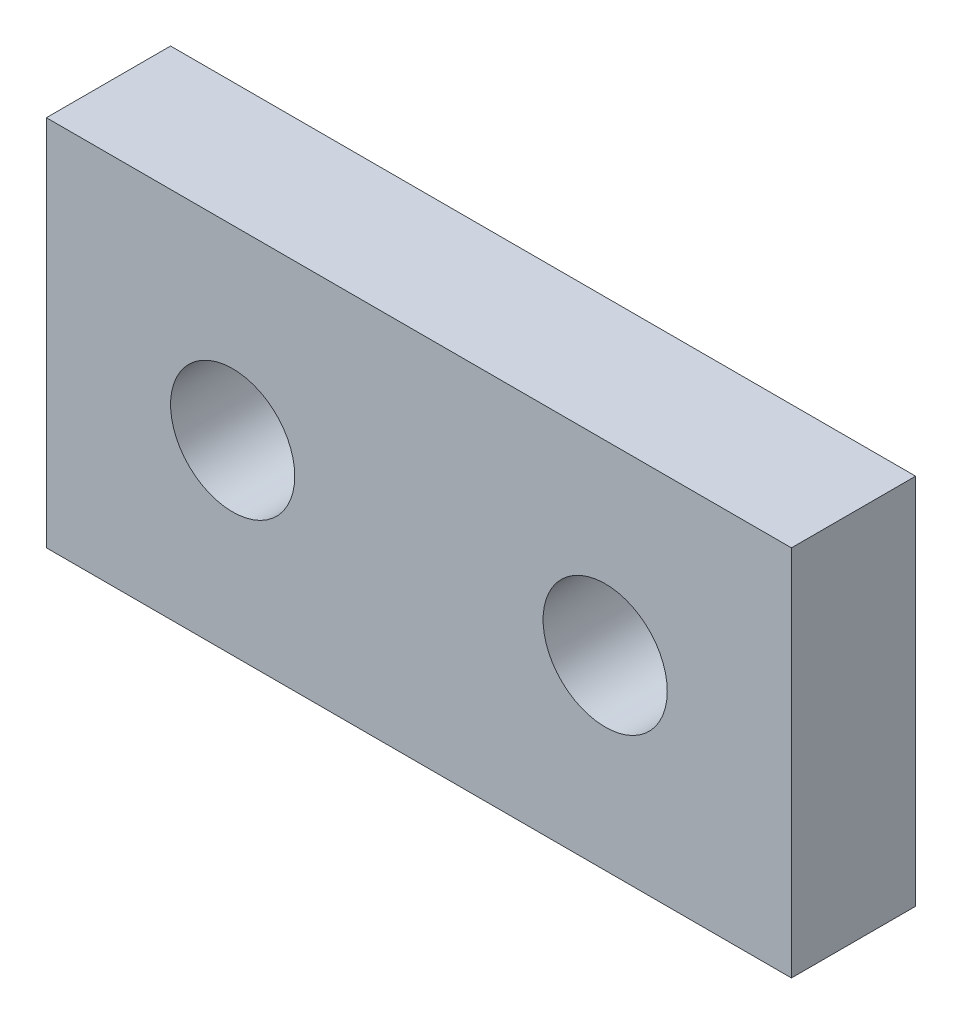
ISO-10303-21;
HEADER;
FILE_DESCRIPTION(('STEP AP214'),'2;1');
FILE_NAME('part.step','',(''),(''),'','','');
FILE_SCHEMA(('AUTOMOTIVE_DESIGN { 1 0 10303 214 1 1 1 1 }'));
ENDSEC;
DATA;
#1=APPLICATION_CONTEXT('core data for automotive mechanical design processes');
#2=APPLICATION_PROTOCOL_DEFINITION('international standard','automotive_design',2000,#1);
#3=PRODUCT_CONTEXT('',#1,'mechanical');
#4=PRODUCT('Part','Part','',(#3));
#5=PRODUCT_RELATED_PRODUCT_CATEGORY('part','',(#4));
#6=PRODUCT_DEFINITION_FORMATION('','',#4);
#7=PRODUCT_DEFINITION_CONTEXT('part definition',#1,'design');
#8=PRODUCT_DEFINITION('design','',#6,#7);
#9=PRODUCT_DEFINITION_SHAPE('','',#8);
#10=(LENGTH_UNIT() NAMED_UNIT(*) SI_UNIT(.MILLI.,.METRE.));
#11=(NAMED_UNIT(*) PLANE_ANGLE_UNIT() SI_UNIT($,.RADIAN.));
#12=(NAMED_UNIT(*) SI_UNIT($,.STERADIAN.) SOLID_ANGLE_UNIT());
#13=UNCERTAINTY_MEASURE_WITH_UNIT(LENGTH_MEASURE(1.E-05),#10,'distance_accuracy_value','');
#14=(GEOMETRIC_REPRESENTATION_CONTEXT(3) GLOBAL_UNCERTAINTY_ASSIGNED_CONTEXT((#13)) GLOBAL_UNIT_ASSIGNED_CONTEXT((#10,
#11,#12)) REPRESENTATION_CONTEXT('',''));
#15=CARTESIAN_POINT('',(0.,0.,0.));
#16=DIRECTION('',(0.,0.,1.));
#17=DIRECTION('',(1.,0.,0.));
#18=AXIS2_PLACEMENT_3D('',#15,#16,#17);
#19=CARTESIAN_POINT('',(0.,0.,10.));
#20=DIRECTION('',(0.,0.,1.));
#21=DIRECTION('',(1.,0.,0.));
#22=AXIS2_PLACEMENT_3D('',#19,#20,#21);
#23=PLANE('',#22);
#24=CARTESIAN_POINT('',(15.,15.,10.));
#25=DIRECTION('',(0.,0.,1.));
#26=DIRECTION('',(1.,0.,0.));
#27=AXIS2_PLACEMENT_3D('',#24,#25,#26);
#28=CIRCLE('',#27,5.);
#29=CARTESIAN_POINT('',(20.,15.,10.));
#30=VERTEX_POINT('',#29);
#31=EDGE_CURVE('E112',#30,#30,#28,.T.);
#32=ORIENTED_EDGE('',*,*,#31,.F.);
#33=EDGE_LOOP('',(#32));
#34=FACE_BOUND('',#33,.T.);
#35=DIRECTION('',(0.,-1.,0.));
#36=VECTOR('',#35,1.);
#37=CARTESIAN_POINT('',(0.,30.,10.));
#38=LINE('',#37,#36);
#39=CARTESIAN_POINT('',(0.,30.,10.));
#40=VERTEX_POINT('',#39);
#41=CARTESIAN_POINT('',(0.,0.,10.));
#42=VERTEX_POINT('',#41);
#43=EDGE_CURVE('E92',#40,#42,#38,.T.);
#44=ORIENTED_EDGE('',*,*,#43,.T.);
#45=DIRECTION('',(1.,0.,0.));
#46=VECTOR('',#45,1.);
#47=CARTESIAN_POINT('',(0.,0.,10.));
#48=LINE('',#47,#46);
#49=CARTESIAN_POINT('',(60.,0.,10.));
#50=VERTEX_POINT('',#49);
#51=EDGE_CURVE('E87',#42,#50,#48,.T.);
#52=ORIENTED_EDGE('',*,*,#51,.T.);
#53=DIRECTION('',(0.,1.,0.));
#54=VECTOR('',#53,1.);
#55=CARTESIAN_POINT('',(60.,0.,10.));
#56=LINE('',#55,#54);
#57=CARTESIAN_POINT('',(60.,30.,10.));
#58=VERTEX_POINT('',#57);
#59=EDGE_CURVE('E90',#50,#58,#56,.T.);
#60=ORIENTED_EDGE('',*,*,#59,.T.);
#61=DIRECTION('',(-1.,0.,0.));
#62=VECTOR('',#61,1.);
#63=CARTESIAN_POINT('',(60.,30.,10.));
#64=LINE('',#63,#62);
#65=EDGE_CURVE('E57',#58,#40,#64,.T.);
#66=ORIENTED_EDGE('',*,*,#65,.T.);
#67=EDGE_LOOP('',(#44,#52,#60,#66));
#68=FACE_BOUND('',#67,.T.);
#69=CARTESIAN_POINT('',(45.,15.,10.));
#70=DIRECTION('',(0.,0.,1.));
#71=DIRECTION('',(1.,0.,0.));
#72=AXIS2_PLACEMENT_3D('',#69,#70,#71);
#73=CIRCLE('',#72,5.);
#74=CARTESIAN_POINT('',(50.,15.,10.));
#75=VERTEX_POINT('',#74);
#76=EDGE_CURVE('E134',#75,#75,#73,.T.);
#77=ORIENTED_EDGE('',*,*,#76,.F.);
#78=EDGE_LOOP('',(#77));
#79=FACE_BOUND('',#78,.T.);
#80=ADVANCED_FACE('F39',(#34,#68,#79),#23,.T.);
#81=CARTESIAN_POINT('',(0.,0.,0.));
#82=DIRECTION('',(0.,0.,1.));
#83=DIRECTION('',(1.,0.,0.));
#84=AXIS2_PLACEMENT_3D('',#81,#82,#83);
#85=PLANE('',#84);
#86=DIRECTION('',(0.,-1.,0.));
#87=VECTOR('',#86,1.);
#88=CARTESIAN_POINT('',(0.,30.,0.));
#89=LINE('',#88,#87);
#90=CARTESIAN_POINT('',(0.,30.,0.));
#91=VERTEX_POINT('',#90);
#92=CARTESIAN_POINT('',(0.,0.,0.));
#93=VERTEX_POINT('',#92);
#94=EDGE_CURVE('E108',#91,#93,#89,.T.);
#95=ORIENTED_EDGE('',*,*,#94,.F.);
#96=DIRECTION('',(-1.,0.,0.));
#97=VECTOR('',#96,1.);
#98=CARTESIAN_POINT('',(60.,30.,0.));
#99=LINE('',#98,#97);
#100=CARTESIAN_POINT('',(60.,30.,0.));
#101=VERTEX_POINT('',#100);
#102=EDGE_CURVE('E80',#101,#91,#99,.T.);
#103=ORIENTED_EDGE('',*,*,#102,.F.);
#104=DIRECTION('',(0.,1.,0.));
#105=VECTOR('',#104,1.);
#106=CARTESIAN_POINT('',(60.,0.,0.));
#107=LINE('',#106,#105);
#108=CARTESIAN_POINT('',(60.,0.,0.));
#109=VERTEX_POINT('',#108);
#110=EDGE_CURVE('E74',#109,#101,#107,.T.);
#111=ORIENTED_EDGE('',*,*,#110,.F.);
#112=DIRECTION('',(1.,0.,0.));
#113=VECTOR('',#112,1.);
#114=CARTESIAN_POINT('',(0.,0.,0.));
#115=LINE('',#114,#113);
#116=EDGE_CURVE('E97',#93,#109,#115,.T.);
#117=ORIENTED_EDGE('',*,*,#116,.F.);
#118=EDGE_LOOP('',(#95,#103,#111,#117));
#119=FACE_BOUND('',#118,.T.);
#120=CARTESIAN_POINT('',(15.,15.,0.));
#121=DIRECTION('',(0.,0.,1.));
#122=DIRECTION('',(1.,0.,0.));
#123=AXIS2_PLACEMENT_3D('',#120,#121,#122);
#124=CIRCLE('',#123,5.);
#125=CARTESIAN_POINT('',(20.,15.,0.));
#126=VERTEX_POINT('',#125);
#127=EDGE_CURVE('E130',#126,#126,#124,.T.);
#128=ORIENTED_EDGE('',*,*,#127,.T.);
#129=EDGE_LOOP('',(#128));
#130=FACE_BOUND('',#129,.T.);
#131=CARTESIAN_POINT('',(45.,15.,0.));
#132=DIRECTION('',(0.,0.,1.));
#133=DIRECTION('',(1.,0.,0.));
#134=AXIS2_PLACEMENT_3D('',#131,#132,#133);
#135=CIRCLE('',#134,5.);
#136=CARTESIAN_POINT('',(50.,15.,0.));
#137=VERTEX_POINT('',#136);
#138=EDGE_CURVE('E138',#137,#137,#135,.T.);
#139=ORIENTED_EDGE('',*,*,#138,.T.);
#140=EDGE_LOOP('',(#139));
#141=FACE_BOUND('',#140,.T.);
#142=ADVANCED_FACE('F125',(#119,#130,#141),#85,.F.);
#143=CARTESIAN_POINT('',(0.,30.,10.));
#144=DIRECTION('',(1.,0.,0.));
#145=DIRECTION('',(0.,0.,-1.));
#146=AXIS2_PLACEMENT_3D('',#143,#144,#145);
#147=PLANE('',#146);
#148=ORIENTED_EDGE('',*,*,#94,.T.);
#149=DIRECTION('',(0.,0.,-1.));
#150=VECTOR('',#149,1.);
#151=CARTESIAN_POINT('',(0.,0.,10.));
#152=LINE('',#151,#150);
#153=EDGE_CURVE('E11',#42,#93,#152,.T.);
#154=ORIENTED_EDGE('',*,*,#153,.F.);
#155=ORIENTED_EDGE('',*,*,#43,.F.);
#156=DIRECTION('',(0.,0.,-1.));
#157=VECTOR('',#156,1.);
#158=CARTESIAN_POINT('',(0.,30.,10.));
#159=LINE('',#158,#157);
#160=EDGE_CURVE('E104',#40,#91,#159,.T.);
#161=ORIENTED_EDGE('',*,*,#160,.T.);
#162=EDGE_LOOP('',(#148,#154,#155,#161));
#163=FACE_BOUND('',#162,.T.);
#164=ADVANCED_FACE('F41',(#163),#147,.F.);
#165=CARTESIAN_POINT('',(0.,0.,10.));
#166=DIRECTION('',(0.,1.,0.));
#167=DIRECTION('',(0.,0.,1.));
#168=AXIS2_PLACEMENT_3D('',#165,#166,#167);
#169=PLANE('',#168);
#170=ORIENTED_EDGE('',*,*,#116,.T.);
#171=DIRECTION('',(0.,0.,-1.));
#172=VECTOR('',#171,1.);
#173=CARTESIAN_POINT('',(60.,0.,10.));
#174=LINE('',#173,#172);
#175=EDGE_CURVE('E49',#50,#109,#174,.T.);
#176=ORIENTED_EDGE('',*,*,#175,.F.);
#177=ORIENTED_EDGE('',*,*,#51,.F.);
#178=ORIENTED_EDGE('',*,*,#153,.T.);
#179=EDGE_LOOP('',(#170,#176,#177,#178));
#180=FACE_BOUND('',#179,.T.);
#181=ADVANCED_FACE('F96',(#180),#169,.F.);
#182=CARTESIAN_POINT('',(60.,0.,10.));
#183=DIRECTION('',(-1.,0.,0.));
#184=DIRECTION('',(0.,0.,1.));
#185=AXIS2_PLACEMENT_3D('',#182,#183,#184);
#186=PLANE('',#185);
#187=ORIENTED_EDGE('',*,*,#110,.T.);
#188=DIRECTION('',(0.,0.,-1.));
#189=VECTOR('',#188,1.);
#190=CARTESIAN_POINT('',(60.,30.,10.));
#191=LINE('',#190,#189);
#192=EDGE_CURVE('E99',#58,#101,#191,.T.);
#193=ORIENTED_EDGE('',*,*,#192,.F.);
#194=ORIENTED_EDGE('',*,*,#59,.F.);
#195=ORIENTED_EDGE('',*,*,#175,.T.);
#196=EDGE_LOOP('',(#187,#193,#194,#195));
#197=FACE_BOUND('',#196,.T.);
#198=ADVANCED_FACE('F100',(#197),#186,.F.);
#199=CARTESIAN_POINT('',(60.,30.,10.));
#200=DIRECTION('',(0.,-1.,0.));
#201=DIRECTION('',(1.,0.,0.));
#202=AXIS2_PLACEMENT_3D('',#199,#200,#201);
#203=PLANE('',#202);
#204=ORIENTED_EDGE('',*,*,#102,.T.);
#205=ORIENTED_EDGE('',*,*,#160,.F.);
#206=ORIENTED_EDGE('',*,*,#65,.F.);
#207=ORIENTED_EDGE('',*,*,#192,.T.);
#208=EDGE_LOOP('',(#204,#205,#206,#207));
#209=FACE_BOUND('',#208,.T.);
#210=ADVANCED_FACE('F122',(#209),#203,.F.);
#211=CARTESIAN_POINT('',(15.,15.,10.));
#212=DIRECTION('',(0.,0.,-1.));
#213=DIRECTION('',(-1.,0.,0.));
#214=AXIS2_PLACEMENT_3D('',#211,#212,#213);
#215=CYLINDRICAL_SURFACE('',#214,5.);
#216=ORIENTED_EDGE('',*,*,#31,.T.);
#217=EDGE_LOOP('',(#216));
#218=FACE_BOUND('',#217,.T.);
#219=ORIENTED_EDGE('',*,*,#127,.F.);
#220=EDGE_LOOP('',(#219));
#221=FACE_BOUND('',#220,.T.);
#222=ADVANCED_FACE('F157',(#218,#221),#215,.F.);
#223=CARTESIAN_POINT('',(45.,15.,10.));
#224=DIRECTION('',(0.,0.,-1.));
#225=DIRECTION('',(-1.,0.,0.));
#226=AXIS2_PLACEMENT_3D('',#223,#224,#225);
#227=CYLINDRICAL_SURFACE('',#226,5.);
#228=ORIENTED_EDGE('',*,*,#76,.T.);
#229=EDGE_LOOP('',(#228));
#230=FACE_BOUND('',#229,.T.);
#231=ORIENTED_EDGE('',*,*,#138,.F.);
#232=EDGE_LOOP('',(#231));
#233=FACE_BOUND('',#232,.T.);
#234=ADVANCED_FACE('F146',(#230,#233),#227,.F.);
#235=CLOSED_SHELL('',(#80,#142,#164,#181,#198,#210,#222,#234));
#236=MANIFOLD_SOLID_BREP('B2',#235);
#237=ADVANCED_BREP_SHAPE_REPRESENTATION('',(#18,#236),#14);
#238=SHAPE_DEFINITION_REPRESENTATION(#9,#237);
ENDSEC;
END-ISO-10303-21;
